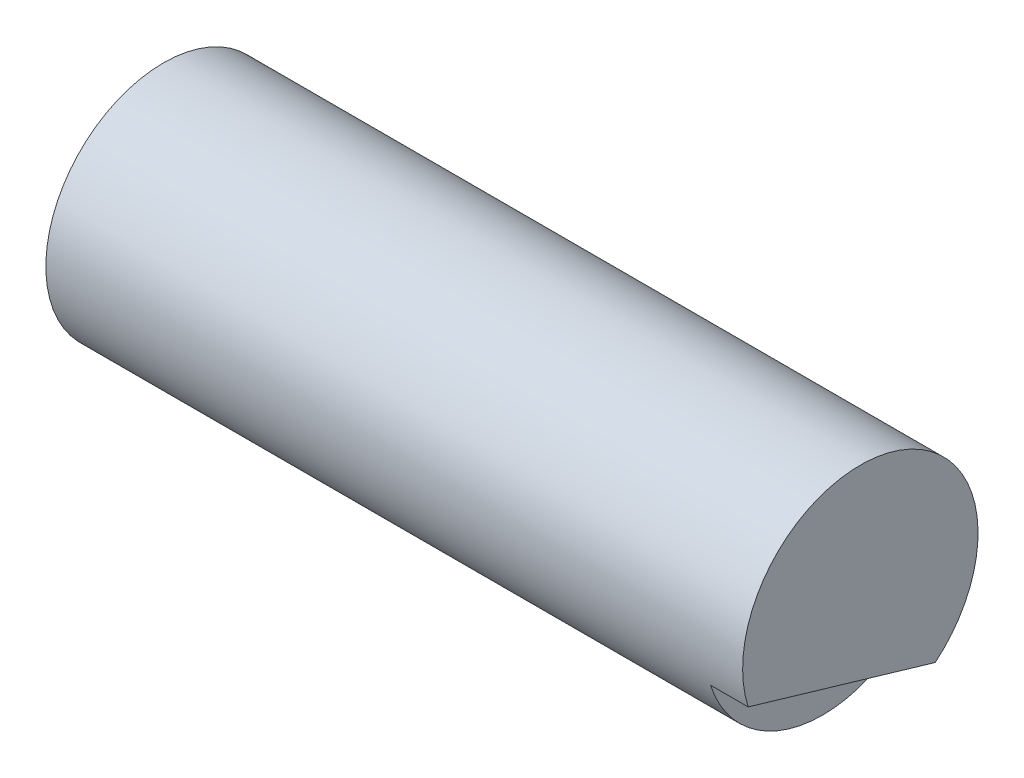
ISO-10303-21;
HEADER;
FILE_DESCRIPTION(('STEP AP214'),'2;1');
FILE_NAME('part.step','',(''),(''),'','','');
FILE_SCHEMA(('AUTOMOTIVE_DESIGN { 1 0 10303 214 1 1 1 1 }'));
ENDSEC;
DATA;
#1=APPLICATION_CONTEXT('core data for automotive mechanical design processes');
#2=APPLICATION_PROTOCOL_DEFINITION('international standard','automotive_design',2000,#1);
#3=PRODUCT_CONTEXT('',#1,'mechanical');
#4=PRODUCT('Part','Part','',(#3));
#5=PRODUCT_RELATED_PRODUCT_CATEGORY('part','',(#4));
#6=PRODUCT_DEFINITION_FORMATION('','',#4);
#7=PRODUCT_DEFINITION_CONTEXT('part definition',#1,'design');
#8=PRODUCT_DEFINITION('design','',#6,#7);
#9=PRODUCT_DEFINITION_SHAPE('','',#8);
#10=(LENGTH_UNIT() NAMED_UNIT(*) SI_UNIT(.MILLI.,.METRE.));
#11=(NAMED_UNIT(*) PLANE_ANGLE_UNIT() SI_UNIT($,.RADIAN.));
#12=(NAMED_UNIT(*) SI_UNIT($,.STERADIAN.) SOLID_ANGLE_UNIT());
#13=UNCERTAINTY_MEASURE_WITH_UNIT(LENGTH_MEASURE(1.E-05),#10,'distance_accuracy_value','');
#14=(GEOMETRIC_REPRESENTATION_CONTEXT(3) GLOBAL_UNCERTAINTY_ASSIGNED_CONTEXT((#13)) GLOBAL_UNIT_ASSIGNED_CONTEXT((#10,
#11,#12)) REPRESENTATION_CONTEXT('',''));
#15=CARTESIAN_POINT('',(0.,0.,0.));
#16=DIRECTION('',(0.,0.,1.));
#17=DIRECTION('',(1.,0.,0.));
#18=AXIS2_PLACEMENT_3D('',#15,#16,#17);
#19=CARTESIAN_POINT('',(69.0000000000002,109.950168602197,-2475.));
#20=DIRECTION('',(-1.,0.,0.));
#21=DIRECTION('',(0.,-1.,0.));
#22=AXIS2_PLACEMENT_3D('',#19,#20,#21);
#23=CYLINDRICAL_SURFACE('',#22,12.5000000000002);
#24=CARTESIAN_POINT('',(-4.99999999999981,109.950168602197,-2475.));
#25=DIRECTION('',(-1.,0.,0.));
#26=DIRECTION('',(0.,-1.,0.));
#27=AXIS2_PLACEMENT_3D('',#24,#25,#26);
#28=CIRCLE('',#27,12.5000000000002);
#29=CARTESIAN_POINT('',(-4.99999999999981,97.4501686021968,-2475.));
#30=VERTEX_POINT('',#29);
#31=EDGE_CURVE('E37',#30,#30,#28,.T.);
#32=ORIENTED_EDGE('',*,*,#31,.F.);
#33=EDGE_LOOP('',(#32));
#34=FACE_BOUND('',#33,.T.);
#35=CARTESIAN_POINT('',(65.0000000000004,109.950168602197,-2475.));
#36=DIRECTION('',(1.,0.,0.));
#37=DIRECTION('',(0.,0.,-1.));
#38=AXIS2_PLACEMENT_3D('',#35,#36,#37);
#39=CIRCLE('',#38,12.5000000000001);
#40=CARTESIAN_POINT('',(65.0000000000004,106.158595838179,-2463.08891373656));
#41=VERTEX_POINT('',#40);
#42=CARTESIAN_POINT('',(65.0000000000004,100.311230387572,-2482.95869776375));
#43=VERTEX_POINT('',#42);
#44=EDGE_CURVE('E64',#41,#43,#39,.T.);
#45=ORIENTED_EDGE('',*,*,#44,.F.);
#46=DIRECTION('',(-1.,0.,0.));
#47=VECTOR('',#46,1.);
#48=CARTESIAN_POINT('',(69.0000000000005,106.158595838179,-2463.08891373656));
#49=LINE('',#48,#47);
#50=CARTESIAN_POINT('',(69.0000000000005,106.158595838179,-2463.08891373656));
#51=VERTEX_POINT('',#50);
#52=EDGE_CURVE('E61',#51,#41,#49,.T.);
#53=ORIENTED_EDGE('',*,*,#52,.F.);
#54=CARTESIAN_POINT('',(69.0000000000002,109.950168602197,-2475.));
#55=DIRECTION('',(-1.,0.,0.));
#56=DIRECTION('',(0.,-1.,0.));
#57=AXIS2_PLACEMENT_3D('',#54,#55,#56);
#58=CIRCLE('',#57,12.5000000000002);
#59=CARTESIAN_POINT('',(69.0000000000002,100.311230387572,-2482.95869776375));
#60=VERTEX_POINT('',#59);
#61=EDGE_CURVE('E11',#51,#60,#58,.T.);
#62=ORIENTED_EDGE('',*,*,#61,.T.);
#63=DIRECTION('',(-1.,0.,0.));
#64=VECTOR('',#63,1.);
#65=CARTESIAN_POINT('',(69.0000000000005,100.311230387572,-2482.95869776375));
#66=LINE('',#65,#64);
#67=EDGE_CURVE('E48',#60,#43,#66,.T.);
#68=ORIENTED_EDGE('',*,*,#67,.T.);
#69=EDGE_LOOP('',(#45,#53,#62,#68));
#70=FACE_BOUND('',#69,.T.);
#71=ADVANCED_FACE('F34',(#34,#70),#23,.T.);
#72=CARTESIAN_POINT('',(69.0000000000002,109.950168602197,-2475.));
#73=DIRECTION('',(-1.,0.,0.));
#74=DIRECTION('',(0.,-1.,0.));
#75=AXIS2_PLACEMENT_3D('',#72,#73,#74);
#76=PLANE('',#75);
#77=DIRECTION('',(0.,0.282313464264068,0.959322212760249));
#78=VECTOR('',#77,1.);
#79=CARTESIAN_POINT('',(69.0000000000005,100.311230387572,-2482.95869776375));
#80=LINE('',#79,#78);
#81=EDGE_CURVE('E53',#60,#51,#80,.T.);
#82=ORIENTED_EDGE('',*,*,#81,.F.);
#83=ORIENTED_EDGE('',*,*,#61,.F.);
#84=EDGE_LOOP('',(#82,#83));
#85=FACE_BOUND('',#84,.T.);
#86=ADVANCED_FACE('F79',(#85),#76,.F.);
#87=CARTESIAN_POINT('',(-4.99999999999981,109.950168602197,-2475.));
#88=DIRECTION('',(-1.,0.,0.));
#89=DIRECTION('',(0.,-1.,0.));
#90=AXIS2_PLACEMENT_3D('',#87,#88,#89);
#91=PLANE('',#90);
#92=ORIENTED_EDGE('',*,*,#31,.T.);
#93=EDGE_LOOP('',(#92));
#94=FACE_BOUND('',#93,.T.);
#95=ADVANCED_FACE('F76',(#94),#91,.T.);
#96=CARTESIAN_POINT('',(69.0000000000005,100.311230387572,-2482.95869776375));
#97=DIRECTION('',(0.,-0.959322212760249,0.282313464264068));
#98=DIRECTION('',(0.,-0.282313464264068,-0.959322212760249));
#99=AXIS2_PLACEMENT_3D('',#96,#97,#98);
#100=PLANE('',#99);
#101=DIRECTION('',(0.,0.282313464264068,0.959322212760249));
#102=VECTOR('',#101,1.);
#103=CARTESIAN_POINT('',(65.0000000000004,100.311230387572,-2482.95869776375));
#104=LINE('',#103,#102);
#105=EDGE_CURVE('E58',#43,#41,#104,.T.);
#106=ORIENTED_EDGE('',*,*,#105,.F.);
#107=ORIENTED_EDGE('',*,*,#67,.F.);
#108=ORIENTED_EDGE('',*,*,#81,.T.);
#109=ORIENTED_EDGE('',*,*,#52,.T.);
#110=EDGE_LOOP('',(#106,#107,#108,#109));
#111=FACE_BOUND('',#110,.T.);
#112=ADVANCED_FACE('F60',(#111),#100,.T.);
#113=CARTESIAN_POINT('',(65.0000000000004,109.950168602197,-2475.));
#114=DIRECTION('',(1.,0.,0.));
#115=DIRECTION('',(0.,0.,-1.));
#116=AXIS2_PLACEMENT_3D('',#113,#114,#115);
#117=PLANE('',#116);
#118=ORIENTED_EDGE('',*,*,#44,.T.);
#119=ORIENTED_EDGE('',*,*,#105,.T.);
#120=EDGE_LOOP('',(#118,#119));
#121=FACE_BOUND('',#120,.T.);
#122=ADVANCED_FACE('F66',(#121),#117,.T.);
#123=CLOSED_SHELL('',(#71,#86,#95,#112,#122));
#124=MANIFOLD_SOLID_BREP('B2',#123);
#125=ADVANCED_BREP_SHAPE_REPRESENTATION('',(#18,#124),#14);
#126=SHAPE_DEFINITION_REPRESENTATION(#9,#125);
ENDSEC;
END-ISO-10303-21;
